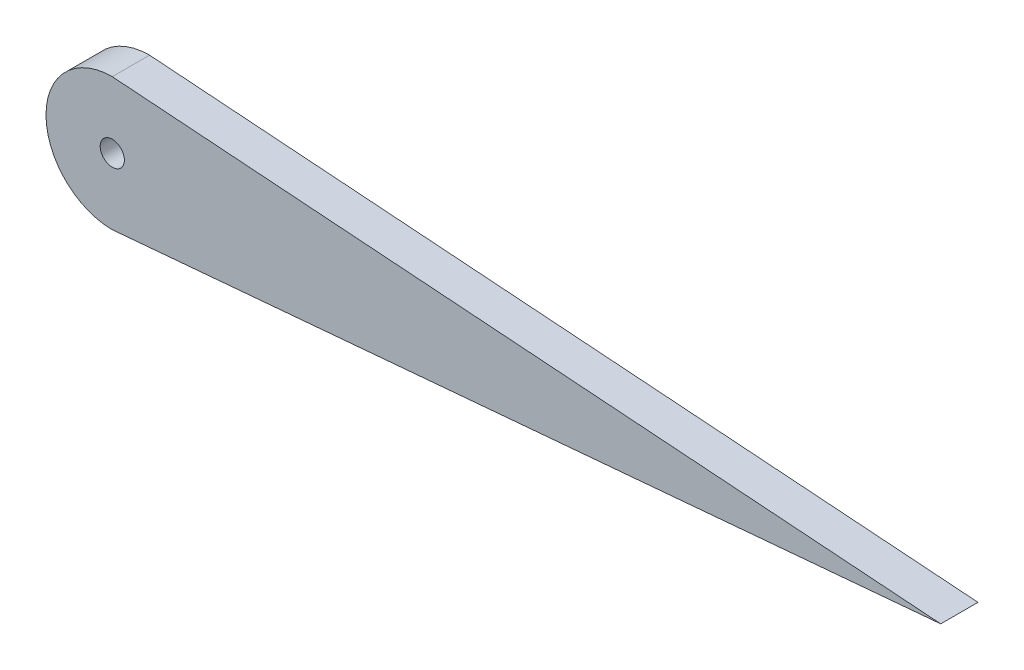
ISO-10303-21;
HEADER;
FILE_DESCRIPTION(('STEP AP214'),'2;1');
FILE_NAME('part.step','',(''),(''),'','','');
FILE_SCHEMA(('AUTOMOTIVE_DESIGN { 1 0 10303 214 1 1 1 1 }'));
ENDSEC;
DATA;
#1=APPLICATION_CONTEXT('core data for automotive mechanical design processes');
#2=APPLICATION_PROTOCOL_DEFINITION('international standard','automotive_design',2000,#1);
#3=PRODUCT_CONTEXT('',#1,'mechanical');
#4=PRODUCT('Part','Part','',(#3));
#5=PRODUCT_RELATED_PRODUCT_CATEGORY('part','',(#4));
#6=PRODUCT_DEFINITION_FORMATION('','',#4);
#7=PRODUCT_DEFINITION_CONTEXT('part definition',#1,'design');
#8=PRODUCT_DEFINITION('design','',#6,#7);
#9=PRODUCT_DEFINITION_SHAPE('','',#8);
#10=(LENGTH_UNIT() NAMED_UNIT(*) SI_UNIT(.MILLI.,.METRE.));
#11=(NAMED_UNIT(*) PLANE_ANGLE_UNIT() SI_UNIT($,.RADIAN.));
#12=(NAMED_UNIT(*) SI_UNIT($,.STERADIAN.) SOLID_ANGLE_UNIT());
#13=UNCERTAINTY_MEASURE_WITH_UNIT(LENGTH_MEASURE(1.E-05),#10,'distance_accuracy_value','');
#14=(GEOMETRIC_REPRESENTATION_CONTEXT(3) GLOBAL_UNCERTAINTY_ASSIGNED_CONTEXT((#13)) GLOBAL_UNIT_ASSIGNED_CONTEXT((#10,
#11,#12)) REPRESENTATION_CONTEXT('',''));
#15=CARTESIAN_POINT('',(0.,0.,0.));
#16=DIRECTION('',(0.,0.,1.));
#17=DIRECTION('',(1.,0.,0.));
#18=AXIS2_PLACEMENT_3D('',#15,#16,#17);
#19=CARTESIAN_POINT('',(0.291120733079813,4.04303772186677,2.286));
#20=DIRECTION('',(0.0718195020815422,0.997417645282436,0.));
#21=DIRECTION('',(-0.997417645282436,0.0718195020815422,0.));
#22=AXIS2_PLACEMENT_3D('',#19,#20,#21);
#23=PLANE('',#22);
#24=DIRECTION('',(0.997417645282436,-0.0718195020815422,0.));
#25=VECTOR('',#24,1.);
#26=CARTESIAN_POINT('',(0.291120733079813,4.04303772186677,0.));
#27=LINE('',#26,#25);
#28=CARTESIAN_POINT('',(0.,4.064,0.));
#29=VERTEX_POINT('',#28);
#30=CARTESIAN_POINT('',(50.7983756512097,0.406240321216759,0.));
#31=VERTEX_POINT('',#30);
#32=EDGE_CURVE('E72',#29,#31,#27,.T.);
#33=ORIENTED_EDGE('',*,*,#32,.F.);
#34=DIRECTION('',(0.,0.,-1.));
#35=VECTOR('',#34,1.);
#36=CARTESIAN_POINT('',(0.,4.064,2.286));
#37=LINE('',#36,#35);
#38=CARTESIAN_POINT('',(0.,4.064,2.286));
#39=VERTEX_POINT('',#38);
#40=EDGE_CURVE('E11',#39,#29,#37,.T.);
#41=ORIENTED_EDGE('',*,*,#40,.F.);
#42=DIRECTION('',(0.997417645282436,-0.0718195020815422,0.));
#43=VECTOR('',#42,1.);
#44=CARTESIAN_POINT('',(0.291120733079813,4.04303772186677,2.286));
#45=LINE('',#44,#43);
#46=CARTESIAN_POINT('',(50.7983756512097,0.406240321216759,2.286));
#47=VERTEX_POINT('',#46);
#48=EDGE_CURVE('E70',#39,#47,#45,.T.);
#49=ORIENTED_EDGE('',*,*,#48,.T.);
#50=DIRECTION('',(0.,0.,-1.));
#51=VECTOR('',#50,1.);
#52=CARTESIAN_POINT('',(50.7983756512097,0.406240321216759,2.286));
#53=LINE('',#52,#51);
#54=EDGE_CURVE('E52',#47,#31,#53,.T.);
#55=ORIENTED_EDGE('',*,*,#54,.T.);
#56=EDGE_LOOP('',(#33,#41,#49,#55));
#57=FACE_BOUND('',#56,.T.);
#58=ADVANCED_FACE('F35',(#57),#23,.T.);
#59=CARTESIAN_POINT('',(0.,0.,2.286));
#60=DIRECTION('',(0.,0.,-1.));
#61=DIRECTION('',(-1.,0.,0.));
#62=AXIS2_PLACEMENT_3D('',#59,#60,#61);
#63=CYLINDRICAL_SURFACE('',#62,4.064);
#64=CARTESIAN_POINT('',(0.,0.,0.));
#65=DIRECTION('',(0.,0.,1.));
#66=DIRECTION('',(1.,0.,0.));
#67=AXIS2_PLACEMENT_3D('',#64,#65,#66);
#68=CIRCLE('',#67,4.064);
#69=CARTESIAN_POINT('',(0.,-4.064,0.));
#70=VERTEX_POINT('',#69);
#71=EDGE_CURVE('E92',#29,#70,#68,.T.);
#72=ORIENTED_EDGE('',*,*,#71,.T.);
#73=DIRECTION('',(0.,0.,-1.));
#74=VECTOR('',#73,1.);
#75=CARTESIAN_POINT('',(0.,-4.064,2.286));
#76=LINE('',#75,#74);
#77=CARTESIAN_POINT('',(0.,-4.064,2.286));
#78=VERTEX_POINT('',#77);
#79=EDGE_CURVE('E44',#78,#70,#76,.T.);
#80=ORIENTED_EDGE('',*,*,#79,.F.);
#81=CARTESIAN_POINT('',(0.,0.,2.286));
#82=DIRECTION('',(0.,0.,1.));
#83=DIRECTION('',(1.,0.,0.));
#84=AXIS2_PLACEMENT_3D('',#81,#82,#83);
#85=CIRCLE('',#84,4.064);
#86=EDGE_CURVE('E75',#39,#78,#85,.T.);
#87=ORIENTED_EDGE('',*,*,#86,.F.);
#88=ORIENTED_EDGE('',*,*,#40,.T.);
#89=EDGE_LOOP('',(#72,#80,#87,#88));
#90=FACE_BOUND('',#89,.T.);
#91=ADVANCED_FACE('F76',(#90),#63,.T.);
#92=CARTESIAN_POINT('',(0.,0.,2.286));
#93=DIRECTION('',(0.,0.,-1.));
#94=DIRECTION('',(-1.,0.,0.));
#95=AXIS2_PLACEMENT_3D('',#92,#93,#94);
#96=CYLINDRICAL_SURFACE('',#95,0.742804179256016);
#97=CARTESIAN_POINT('',(0.,0.,2.286));
#98=DIRECTION('',(0.,0.,1.));
#99=DIRECTION('',(1.,0.,0.));
#100=AXIS2_PLACEMENT_3D('',#97,#98,#99);
#101=CIRCLE('',#100,0.742804179256016);
#102=CARTESIAN_POINT('',(0.742804179256016,0.,2.286));
#103=VERTEX_POINT('',#102);
#104=EDGE_CURVE('E81',#103,#103,#101,.T.);
#105=ORIENTED_EDGE('',*,*,#104,.T.);
#106=EDGE_LOOP('',(#105));
#107=FACE_BOUND('',#106,.T.);
#108=CARTESIAN_POINT('',(0.,0.,0.));
#109=DIRECTION('',(0.,0.,1.));
#110=DIRECTION('',(1.,0.,0.));
#111=AXIS2_PLACEMENT_3D('',#108,#109,#110);
#112=CIRCLE('',#111,0.742804179256016);
#113=CARTESIAN_POINT('',(0.742804179256016,0.,0.));
#114=VERTEX_POINT('',#113);
#115=EDGE_CURVE('E88',#114,#114,#112,.T.);
#116=ORIENTED_EDGE('',*,*,#115,.F.);
#117=EDGE_LOOP('',(#116));
#118=FACE_BOUND('',#117,.T.);
#119=ADVANCED_FACE('F37',(#107,#118),#96,.F.);
#120=CARTESIAN_POINT('',(0.354882471786375,-4.03277045940278,2.286));
#121=DIRECTION('',(0.0876609046386871,-0.996150373085272,0.));
#122=DIRECTION('',(0.996150373085272,0.0876609046386871,0.));
#123=AXIS2_PLACEMENT_3D('',#120,#121,#122);
#124=PLANE('',#123);
#125=DIRECTION('',(-0.996150373085272,-0.0876609046386871,0.));
#126=VECTOR('',#125,1.);
#127=CARTESIAN_POINT('',(0.354882471786375,-4.03277045940278,0.));
#128=LINE('',#127,#126);
#129=EDGE_CURVE('E84',#31,#70,#128,.T.);
#130=ORIENTED_EDGE('',*,*,#129,.F.);
#131=ORIENTED_EDGE('',*,*,#54,.F.);
#132=DIRECTION('',(-0.996150373085272,-0.0876609046386871,0.));
#133=VECTOR('',#132,1.);
#134=CARTESIAN_POINT('',(0.354882471786375,-4.03277045940278,2.286));
#135=LINE('',#134,#133);
#136=EDGE_CURVE('E78',#47,#78,#135,.T.);
#137=ORIENTED_EDGE('',*,*,#136,.T.);
#138=ORIENTED_EDGE('',*,*,#79,.T.);
#139=EDGE_LOOP('',(#130,#131,#137,#138));
#140=FACE_BOUND('',#139,.T.);
#141=ADVANCED_FACE('F98',(#140),#124,.T.);
#142=CARTESIAN_POINT('',(0.,0.,2.286));
#143=DIRECTION('',(0.,0.,1.));
#144=DIRECTION('',(1.,0.,0.));
#145=AXIS2_PLACEMENT_3D('',#142,#143,#144);
#146=PLANE('',#145);
#147=ORIENTED_EDGE('',*,*,#104,.F.);
#148=EDGE_LOOP('',(#147));
#149=FACE_BOUND('',#148,.T.);
#150=ORIENTED_EDGE('',*,*,#48,.F.);
#151=ORIENTED_EDGE('',*,*,#86,.T.);
#152=ORIENTED_EDGE('',*,*,#136,.F.);
#153=EDGE_LOOP('',(#150,#151,#152));
#154=FACE_BOUND('',#153,.T.);
#155=ADVANCED_FACE('F80',(#149,#154),#146,.T.);
#156=CARTESIAN_POINT('',(0.,0.,0.));
#157=DIRECTION('',(0.,0.,1.));
#158=DIRECTION('',(1.,0.,0.));
#159=AXIS2_PLACEMENT_3D('',#156,#157,#158);
#160=PLANE('',#159);
#161=ORIENTED_EDGE('',*,*,#115,.T.);
#162=EDGE_LOOP('',(#161));
#163=FACE_BOUND('',#162,.T.);
#164=ORIENTED_EDGE('',*,*,#32,.T.);
#165=ORIENTED_EDGE('',*,*,#129,.T.);
#166=ORIENTED_EDGE('',*,*,#71,.F.);
#167=EDGE_LOOP('',(#164,#165,#166));
#168=FACE_BOUND('',#167,.T.);
#169=ADVANCED_FACE('F97',(#163,#168),#160,.F.);
#170=CLOSED_SHELL('',(#58,#91,#119,#141,#155,#169));
#171=MANIFOLD_SOLID_BREP('B2',#170);
#172=ADVANCED_BREP_SHAPE_REPRESENTATION('',(#18,#171),#14);
#173=SHAPE_DEFINITION_REPRESENTATION(#9,#172);
ENDSEC;
END-ISO-10303-21;
